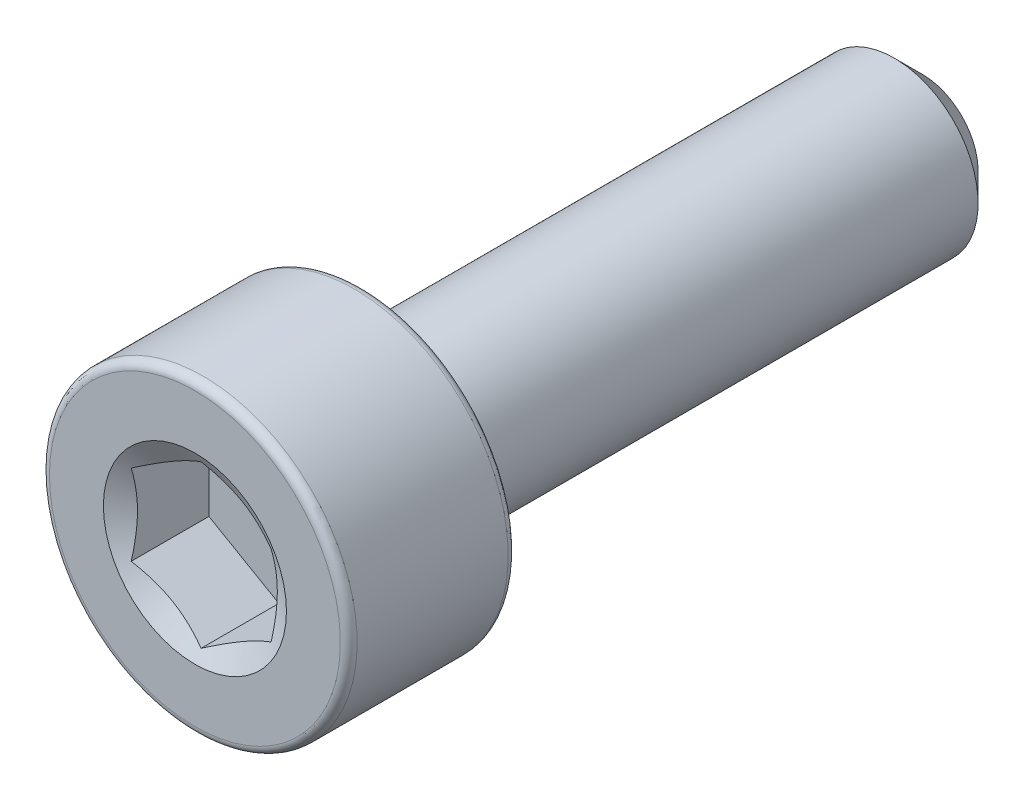
ISO-10303-21;
HEADER;
FILE_DESCRIPTION(('STEP AP214'),'2;1');
FILE_NAME('part.step','',(''),(''),'','','');
FILE_SCHEMA(('AUTOMOTIVE_DESIGN { 1 0 10303 214 1 1 1 1 }'));
ENDSEC;
DATA;
#1=APPLICATION_CONTEXT('core data for automotive mechanical design processes');
#2=APPLICATION_PROTOCOL_DEFINITION('international standard','automotive_design',2000,#1);
#3=PRODUCT_CONTEXT('',#1,'mechanical');
#4=PRODUCT('Part','Part','',(#3));
#5=PRODUCT_RELATED_PRODUCT_CATEGORY('part','',(#4));
#6=PRODUCT_DEFINITION_FORMATION('','',#4);
#7=PRODUCT_DEFINITION_CONTEXT('part definition',#1,'design');
#8=PRODUCT_DEFINITION('design','',#6,#7);
#9=PRODUCT_DEFINITION_SHAPE('','',#8);
#10=(LENGTH_UNIT() NAMED_UNIT(*) SI_UNIT(.MILLI.,.METRE.));
#11=(NAMED_UNIT(*) PLANE_ANGLE_UNIT() SI_UNIT($,.RADIAN.));
#12=(NAMED_UNIT(*) SI_UNIT($,.STERADIAN.) SOLID_ANGLE_UNIT());
#13=UNCERTAINTY_MEASURE_WITH_UNIT(LENGTH_MEASURE(1.E-05),#10,'distance_accuracy_value','');
#14=(GEOMETRIC_REPRESENTATION_CONTEXT(3) GLOBAL_UNCERTAINTY_ASSIGNED_CONTEXT((#13)) GLOBAL_UNIT_ASSIGNED_CONTEXT((#10,
#11,#12)) REPRESENTATION_CONTEXT('',''));
#15=CARTESIAN_POINT('',(0.,0.,0.));
#16=DIRECTION('',(0.,0.,1.));
#17=DIRECTION('',(1.,0.,0.));
#18=AXIS2_PLACEMENT_3D('',#15,#16,#17);
#19=CARTESIAN_POINT('',(0.,0.,-6.5));
#20=DIRECTION('',(0.,0.,-1.));
#21=DIRECTION('',(-1.,0.,0.));
#22=AXIS2_PLACEMENT_3D('',#19,#20,#21);
#23=PLANE('',#22);
#24=CARTESIAN_POINT('',(0.,0.,-6.5));
#25=DIRECTION('',(0.,0.,-1.));
#26=DIRECTION('',(-1.,0.,0.));
#27=AXIS2_PLACEMENT_3D('',#24,#25,#26);
#28=CIRCLE('',#27,1.);
#29=CARTESIAN_POINT('',(-1.,0.,-6.5));
#30=VERTEX_POINT('',#29);
#31=EDGE_CURVE('E61',#30,#30,#28,.T.);
#32=ORIENTED_EDGE('',*,*,#31,.T.);
#33=EDGE_LOOP('',(#32));
#34=FACE_BOUND('',#33,.T.);
#35=ADVANCED_FACE('F47',(#34),#23,.T.);
#36=CARTESIAN_POINT('',(0.,0.,-6.5));
#37=DIRECTION('',(0.,0.,1.));
#38=DIRECTION('',(1.,0.,0.));
#39=AXIS2_PLACEMENT_3D('',#36,#37,#38);
#40=CONICAL_SURFACE('',#39,1.,0.785398163397449);
#41=CARTESIAN_POINT('',(0.,0.,-6.));
#42=DIRECTION('',(0.,0.,-1.));
#43=DIRECTION('',(-1.,0.,0.));
#44=AXIS2_PLACEMENT_3D('',#41,#42,#43);
#45=CIRCLE('',#44,1.50000000000001);
#46=CARTESIAN_POINT('',(-1.50000000000001,0.,-6.));
#47=VERTEX_POINT('',#46);
#48=EDGE_CURVE('E155',#47,#47,#45,.T.);
#49=ORIENTED_EDGE('',*,*,#48,.T.);
#50=EDGE_LOOP('',(#49));
#51=FACE_BOUND('',#50,.T.);
#52=ORIENTED_EDGE('',*,*,#31,.F.);
#53=EDGE_LOOP('',(#52));
#54=FACE_BOUND('',#53,.T.);
#55=ADVANCED_FACE('F163',(#51,#54),#40,.T.);
#56=CARTESIAN_POINT('',(0.,0.,-6.5));
#57=DIRECTION('',(0.,0.,-1.));
#58=DIRECTION('',(-1.,0.,0.));
#59=AXIS2_PLACEMENT_3D('',#56,#57,#58);
#60=CYLINDRICAL_SURFACE('',#59,1.5);
#61=CARTESIAN_POINT('',(0.,0.,3.5));
#62=DIRECTION('',(0.,0.,-1.));
#63=DIRECTION('',(-1.,0.,0.));
#64=AXIS2_PLACEMENT_3D('',#61,#62,#63);
#65=CIRCLE('',#64,1.5);
#66=CARTESIAN_POINT('',(-1.5,0.,3.5));
#67=VERTEX_POINT('',#66);
#68=EDGE_CURVE('E151',#67,#67,#65,.T.);
#69=ORIENTED_EDGE('',*,*,#68,.T.);
#70=EDGE_LOOP('',(#69));
#71=FACE_BOUND('',#70,.T.);
#72=ORIENTED_EDGE('',*,*,#48,.F.);
#73=EDGE_LOOP('',(#72));
#74=FACE_BOUND('',#73,.T.);
#75=ADVANCED_FACE('F165',(#71,#74),#60,.T.);
#76=CARTESIAN_POINT('',(0.,1.5,3.5));
#77=DIRECTION('',(0.,0.,-1.));
#78=DIRECTION('',(-1.,0.,0.));
#79=AXIS2_PLACEMENT_3D('',#76,#77,#78);
#80=PLANE('',#79);
#81=CARTESIAN_POINT('',(0.,0.,3.5));
#82=DIRECTION('',(0.,0.,-1.));
#83=DIRECTION('',(-1.,0.,0.));
#84=AXIS2_PLACEMENT_3D('',#81,#82,#83);
#85=CIRCLE('',#84,2.6);
#86=CARTESIAN_POINT('',(-2.6,0.,3.5));
#87=VERTEX_POINT('',#86);
#88=EDGE_CURVE('E147',#87,#87,#85,.T.);
#89=ORIENTED_EDGE('',*,*,#88,.T.);
#90=EDGE_LOOP('',(#89));
#91=FACE_BOUND('',#90,.T.);
#92=ORIENTED_EDGE('',*,*,#68,.F.);
#93=EDGE_LOOP('',(#92));
#94=FACE_BOUND('',#93,.T.);
#95=ADVANCED_FACE('F171',(#91,#94),#80,.T.);
#96=CARTESIAN_POINT('',(0.,0.,3.65));
#97=DIRECTION('',(0.,0.,-1.));
#98=DIRECTION('',(-1.,0.,0.));
#99=AXIS2_PLACEMENT_3D('',#96,#97,#98);
#100=TOROIDAL_SURFACE('',#99,2.6,0.15);
#101=CARTESIAN_POINT('',(0.,0.,3.65));
#102=DIRECTION('',(0.,0.,-1.));
#103=DIRECTION('',(-1.,0.,0.));
#104=AXIS2_PLACEMENT_3D('',#101,#102,#103);
#105=CIRCLE('',#104,2.75);
#106=CARTESIAN_POINT('',(-2.75,0.,3.65));
#107=VERTEX_POINT('',#106);
#108=EDGE_CURVE('E143',#107,#107,#105,.T.);
#109=ORIENTED_EDGE('',*,*,#108,.T.);
#110=EDGE_LOOP('',(#109));
#111=FACE_BOUND('',#110,.T.);
#112=ORIENTED_EDGE('',*,*,#88,.F.);
#113=EDGE_LOOP('',(#112));
#114=FACE_BOUND('',#113,.T.);
#115=ADVANCED_FACE('F177',(#111,#114),#100,.T.);
#116=CARTESIAN_POINT('',(0.,0.,-6.5));
#117=DIRECTION('',(0.,0.,-1.));
#118=DIRECTION('',(-1.,0.,0.));
#119=AXIS2_PLACEMENT_3D('',#116,#117,#118);
#120=CYLINDRICAL_SURFACE('',#119,2.75);
#121=CARTESIAN_POINT('',(0.,0.,6.35));
#122=DIRECTION('',(0.,0.,-1.));
#123=DIRECTION('',(-1.,0.,0.));
#124=AXIS2_PLACEMENT_3D('',#121,#122,#123);
#125=CIRCLE('',#124,2.75);
#126=CARTESIAN_POINT('',(-2.75,0.,6.35));
#127=VERTEX_POINT('',#126);
#128=EDGE_CURVE('E139',#127,#127,#125,.T.);
#129=ORIENTED_EDGE('',*,*,#128,.T.);
#130=EDGE_LOOP('',(#129));
#131=FACE_BOUND('',#130,.T.);
#132=ORIENTED_EDGE('',*,*,#108,.F.);
#133=EDGE_LOOP('',(#132));
#134=FACE_BOUND('',#133,.T.);
#135=ADVANCED_FACE('F181',(#131,#134),#120,.T.);
#136=CARTESIAN_POINT('',(0.,0.,6.35));
#137=DIRECTION('',(0.,0.,-1.));
#138=DIRECTION('',(-1.,0.,0.));
#139=AXIS2_PLACEMENT_3D('',#136,#137,#138);
#140=TOROIDAL_SURFACE('',#139,2.6,0.150000000000001);
#141=CARTESIAN_POINT('',(0.,0.,6.5));
#142=DIRECTION('',(0.,0.,-1.));
#143=DIRECTION('',(-1.,0.,0.));
#144=AXIS2_PLACEMENT_3D('',#141,#142,#143);
#145=CIRCLE('',#144,2.6);
#146=CARTESIAN_POINT('',(-2.6,0.,6.5));
#147=VERTEX_POINT('',#146);
#148=EDGE_CURVE('E135',#147,#147,#145,.T.);
#149=ORIENTED_EDGE('',*,*,#148,.T.);
#150=EDGE_LOOP('',(#149));
#151=FACE_BOUND('',#150,.T.);
#152=ORIENTED_EDGE('',*,*,#128,.F.);
#153=EDGE_LOOP('',(#152));
#154=FACE_BOUND('',#153,.T.);
#155=ADVANCED_FACE('F185',(#151,#154),#140,.T.);
#156=CARTESIAN_POINT('',(0.,2.6,6.5));
#157=DIRECTION('',(0.,0.,1.));
#158=DIRECTION('',(1.,0.,0.));
#159=AXIS2_PLACEMENT_3D('',#156,#157,#158);
#160=PLANE('',#159);
#161=CARTESIAN_POINT('',(0.,0.,6.5));
#162=DIRECTION('',(0.,0.,1.));
#163=DIRECTION('',(1.,0.,0.));
#164=AXIS2_PLACEMENT_3D('',#161,#162,#163);
#165=CIRCLE('',#164,1.63614639414505);
#166=CARTESIAN_POINT('',(1.63614639414505,0.,6.5));
#167=VERTEX_POINT('',#166);
#168=EDGE_CURVE('E293',#167,#167,#165,.T.);
#169=ORIENTED_EDGE('',*,*,#168,.F.);
#170=EDGE_LOOP('',(#169));
#171=FACE_BOUND('',#170,.T.);
#172=ORIENTED_EDGE('',*,*,#148,.F.);
#173=EDGE_LOOP('',(#172));
#174=FACE_BOUND('',#173,.T.);
#175=ADVANCED_FACE('F189',(#171,#174),#160,.T.);
#176=CARTESIAN_POINT('',(0.,0.,6.5));
#177=DIRECTION('',(0.,0.,1.));
#178=DIRECTION('',(1.,0.,0.));
#179=AXIS2_PLACEMENT_3D('',#176,#177,#178);
#180=CONICAL_SURFACE('',#179,1.63614639414505,1.0471975511966);
#181=ORIENTED_EDGE('',*,*,#168,.T.);
#182=EDGE_LOOP('',(#181));
#183=FACE_BOUND('',#182,.T.);
#184=CARTESIAN_POINT('',(1.2502,0.721572366433195,6.38877044690608));
#185=CARTESIAN_POINT('',(1.19526669476823,0.75328812499623,6.37044968700374));
#186=CARTESIAN_POINT('',(1.13985921349976,0.785277649221703,6.35378707844069));
#187=CARTESIAN_POINT('',(1.02808463239966,0.849810733708404,6.32470107618582));
#188=CARTESIAN_POINT('',(0.971715545158287,0.882355441401182,6.3122879742161));
#189=CARTESIAN_POINT('',(0.859676025913013,0.947041487997317,6.29296345987607));
#190=CARTESIAN_POINT('',(0.804022841540768,0.979172868975893,6.28592346168749));
#191=CARTESIAN_POINT('',(0.692454346091606,1.04358696985655,6.27751620487069));
#192=CARTESIAN_POINT('',(0.636539441062398,1.07586945532687,6.27614198744478));
#193=CARTESIAN_POINT('',(0.532042078818273,1.13620103554812,6.27898710960797));
#194=CARTESIAN_POINT('',(0.483444050118683,1.16425912049992,6.28250787106007));
#195=CARTESIAN_POINT('',(0.386564637826761,1.22019247526559,6.29367088493931));
#196=CARTESIAN_POINT('',(0.338283589807836,1.24806755133608,6.30131695781273));
#197=CARTESIAN_POINT('',(0.241204116145956,1.30411641158755,6.32043322694059));
#198=CARTESIAN_POINT('',(0.1924179896481,1.33228309485381,6.33198452921971));
#199=CARTESIAN_POINT('',(0.0955737477078976,1.38819614400745,6.35820208693394));
#200=CARTESIAN_POINT('',(0.0475143896730355,1.41594322730595,6.37286217437916));
#201=CARTESIAN_POINT('',(-0.000199999999999989,1.4434911430279,6.38877044690608));
#202=B_SPLINE_CURVE_WITH_KNOTS('',3,(#184,#185,#186,#187,#188,#189,#190,#191,#192,#193,#194,
#195,#196,#197,#198,#199,#200,#201),.UNSPECIFIED.,.F.,.F.,(4,2,2,2,2,2,2,2,4),(0.,
0.198150821029559,0.396778196315219,0.590488617354398,0.78396104931718,0.952480056398644,
1.12115539730009,1.29357430343589,1.4656542697693),.UNSPECIFIED.);
#203=CARTESIAN_POINT('',(1.25,0.721687836487033,6.38870377224005));
#204=VERTEX_POINT('',#203);
#205=CARTESIAN_POINT('',(0.,1.44337567297406,6.38870377224005));
#206=VERTEX_POINT('',#205);
#207=EDGE_CURVE('E116',#204,#206,#202,.T.);
#208=ORIENTED_EDGE('',*,*,#207,.F.);
#209=CARTESIAN_POINT('',(1.25,-1.89493751838585,6.86600491612075));
#210=CARTESIAN_POINT('',(1.25,-1.8406706655359,6.83985913696477));
#211=CARTESIAN_POINT('',(1.25,-1.78627450159955,6.81397718008944));
#212=CARTESIAN_POINT('',(1.25,-1.6771542860939,6.76289014495151));
#213=CARTESIAN_POINT('',(1.25,-1.62243018006471,6.73768518315142));
#214=CARTESIAN_POINT('',(1.25,-1.51228150660141,6.68796514956817));
#215=CARTESIAN_POINT('',(1.25,-1.45685471363781,6.66345498656184));
#216=CARTESIAN_POINT('',(1.25,-1.34554530711243,6.61549912463354));
#217=CARTESIAN_POINT('',(1.25,-1.28966271671259,6.59205337201483));
#218=CARTESIAN_POINT('',(1.25,-1.17576624467955,6.5458644070109));
#219=CARTESIAN_POINT('',(1.25,-1.11773662338739,6.52315949733902));
#220=CARTESIAN_POINT('',(1.25,-1.00099484939335,6.4795841161061));
#221=CARTESIAN_POINT('',(1.25,-0.942282613107525,6.45871387193022));
#222=CARTESIAN_POINT('',(1.25,-0.765204349689548,6.39970721918192));
#223=CARTESIAN_POINT('',(1.25,-0.645583882597417,6.36504221898047));
#224=CARTESIAN_POINT('',(1.25,-0.463875702209305,6.32448382828725));
#225=CARTESIAN_POINT('',(1.25,-0.403068506127042,6.31288446104471));
#226=CARTESIAN_POINT('',(1.25,-0.280742753480581,6.29425184547974));
#227=CARTESIAN_POINT('',(1.25,-0.219224254757729,6.28721822850307));
#228=CARTESIAN_POINT('',(1.25,-0.0965698763728656,6.27836802265131));
#229=CARTESIAN_POINT('',(1.25,-0.0354387064128367,6.27648784576509));
#230=CARTESIAN_POINT('',(1.25,0.0867606380824929,6.27793281417568));
#231=CARTESIAN_POINT('',(1.25,0.147828809085717,6.28125823697792));
#232=CARTESIAN_POINT('',(1.25,0.296976974516787,6.29544420543106));
#233=CARTESIAN_POINT('',(1.25,0.384798095172699,6.30902990246888));
#234=CARTESIAN_POINT('',(1.25,0.558777035574827,6.34447190806478));
#235=CARTESIAN_POINT('',(1.25,0.644932779078741,6.36633791854767));
#236=CARTESIAN_POINT('',(1.25,0.77380914518999,6.40387295213096));
#237=CARTESIAN_POINT('',(1.25,0.81719238174285,6.41735279334266));
#238=CARTESIAN_POINT('',(1.25,0.903507427578147,6.44560647226415));
#239=CARTESIAN_POINT('',(1.25,0.946439496790639,6.4603795133102));
#240=CARTESIAN_POINT('',(1.25,1.0319081887352,6.49100070625673));
#241=CARTESIAN_POINT('',(1.25,1.07444487142949,6.50684869200918));
#242=CARTESIAN_POINT('',(1.25,1.1591793213938,6.53944353145432));
#243=CARTESIAN_POINT('',(1.25,1.20137703155215,6.55619053311117));
#244=CARTESIAN_POINT('',(1.25,1.31147066873609,6.6010154405937));
#245=CARTESIAN_POINT('',(1.25,1.37912101228275,6.62969595195012));
#246=CARTESIAN_POINT('',(1.25,1.51378271024307,6.68852402727517));
#247=CARTESIAN_POINT('',(1.25,1.58079400934832,6.71867171687233));
#248=CARTESIAN_POINT('',(1.25,1.78108956687594,6.81078601123408));
#249=CARTESIAN_POINT('',(1.25,1.91360872404133,6.87441259290478));
#250=CARTESIAN_POINT('',(1.25,2.1774904257434,7.00442585055039));
#251=CARTESIAN_POINT('',(1.25,2.30885117753144,7.07081611925632));
#252=CARTESIAN_POINT('',(1.25,2.57065126490253,7.2053391118623));
#253=CARTESIAN_POINT('',(1.25,2.70109073231446,7.2734715797448));
#254=CARTESIAN_POINT('',(1.25,2.94850263370539,7.40414820328686));
#255=CARTESIAN_POINT('',(1.25,3.06553428019949,7.46658065906644));
#256=CARTESIAN_POINT('',(1.25,3.29922001606908,7.59215959614652));
#257=CARTESIAN_POINT('',(1.25,3.41587408902236,7.6553061079814));
#258=CARTESIAN_POINT('',(1.25,3.64856969126785,7.78195631097187));
#259=CARTESIAN_POINT('',(1.25,3.76461202236081,7.84545853098273));
#260=CARTESIAN_POINT('',(1.25,3.99646186521794,7.97287436696805));
#261=CARTESIAN_POINT('',(1.25,4.1122693903072,8.03678795868639));
#262=CARTESIAN_POINT('',(1.25,4.22799321071854,8.10085183344895));
#263=B_SPLINE_CURVE_WITH_KNOTS('',3,(#209,#210,#211,#212,#213,#214,#215,#216,#217,#218,#219,
#220,#221,#222,#223,#224,#225,#226,#227,#228,#229,#230,#231,#232,#233,#234,#235,#236,#237,#238,
#239,#240,#241,#242,#243,#244,#245,#246,#247,#248,#249,#250,#251,#252,#253,#254,#255,#256,#257,
#258,#259,#260,#261,#262),.UNSPECIFIED.,.F.,.F.,(4,2,2,2,2,2,2,2,2,2,2,2,2,2,2,2,2,2,2,2,2,2,2,
2,2,2,4),(0.,0.180713106709462,0.36145710467235,0.543260352902967,0.725054419415467,
0.911961247319592,1.09889120755788,1.47173308257774,1.65730634844025,1.84286462862096,
2.02612278274384,2.20939070651185,2.47544204664139,2.74180608470687,2.87807807877766,
3.0142667067179,3.15043433252001,3.28662443853954,3.50703539668476,3.72746526104871,
4.16841202675703,4.60995110052814,5.05142565849164,5.44935247276722,5.84729636797905,
6.24413951198687,6.64095946708081),.UNSPECIFIED.);
#264=CARTESIAN_POINT('',(1.25,-0.721687836487029,6.38870377224005));
#265=VERTEX_POINT('',#264);
#266=EDGE_CURVE('E235',#265,#204,#263,.T.);
#267=ORIENTED_EDGE('',*,*,#266,.F.);
#268=CARTESIAN_POINT('',(-0.000200000000001979,-1.4434911430279,6.38877044690608));
#269=CARTESIAN_POINT('',(0.0547333052317629,-1.41177538446486,6.37044968700374));
#270=CARTESIAN_POINT('',(0.110140786500237,-1.37978586023939,6.35378707844069));
#271=CARTESIAN_POINT('',(0.221915367600337,-1.31525277575269,6.32470107618582));
#272=CARTESIAN_POINT('',(0.278284454841708,-1.28270806805991,6.3122879742161));
#273=CARTESIAN_POINT('',(0.390323974086981,-1.21802202146378,6.29296345987607));
#274=CARTESIAN_POINT('',(0.445977158459226,-1.1858906404852,6.28592346168749));
#275=CARTESIAN_POINT('',(0.557545653908388,-1.12147653960455,6.27751620487069));
#276=CARTESIAN_POINT('',(0.613460558937597,-1.08919405413422,6.27614198744478));
#277=CARTESIAN_POINT('',(0.717957921181721,-1.02886247391297,6.27898710960797));
#278=CARTESIAN_POINT('',(0.766555949881312,-1.00080438896118,6.28250787106007));
#279=CARTESIAN_POINT('',(0.863435362173234,-0.944871034195501,6.29367088493931));
#280=CARTESIAN_POINT('',(0.911716410192159,-0.916995958125017,6.30131695781273));
#281=CARTESIAN_POINT('',(1.00879588385404,-0.860947097873544,6.32043322694058));
#282=CARTESIAN_POINT('',(1.0575820103519,-0.832780414607287,6.33198452921971));
#283=CARTESIAN_POINT('',(1.1544262522921,-0.776867365453646,6.35820208693394));
#284=CARTESIAN_POINT('',(1.20248561032696,-0.749120282155138,6.37286217437916));
#285=CARTESIAN_POINT('',(1.2502,-0.721572366433192,6.38877044690608));
#286=B_SPLINE_CURVE_WITH_KNOTS('',3,(#268,#269,#270,#271,#272,#273,#274,#275,#276,#277,#278,
#279,#280,#281,#282,#283,#284,#285),.UNSPECIFIED.,.F.,.F.,(4,2,2,2,2,2,2,2,4),(0.,
0.198150821029559,0.39677819631522,0.590488617354398,0.78396104931718,0.952480056398644,
1.1211553973001,1.2935743034359,1.4656542697693),.UNSPECIFIED.);
#287=CARTESIAN_POINT('',(0.,-1.44337567297406,6.38870377224005));
#288=VERTEX_POINT('',#287);
#289=EDGE_CURVE('E229',#288,#265,#286,.T.);
#290=ORIENTED_EDGE('',*,*,#289,.F.);
#291=CARTESIAN_POINT('',(-1.2502,-0.721572366433194,6.38877044690608));
#292=CARTESIAN_POINT('',(-1.19526669476823,-0.753288124996229,6.37044968700374));
#293=CARTESIAN_POINT('',(-1.13985921349976,-0.785277649221702,6.35378707844069));
#294=CARTESIAN_POINT('',(-1.02808463239966,-0.849810733708402,6.32470107618582));
#295=CARTESIAN_POINT('',(-0.971715545158288,-0.882355441401181,6.3122879742161));
#296=CARTESIAN_POINT('',(-0.859676025913014,-0.947041487997316,6.29296345987607));
#297=CARTESIAN_POINT('',(-0.804022841540769,-0.979172868975892,6.28592346168749));
#298=CARTESIAN_POINT('',(-0.692454346091608,-1.04358696985655,6.27751620487069));
#299=CARTESIAN_POINT('',(-0.636539441062399,-1.07586945532687,6.27614198744478));
#300=CARTESIAN_POINT('',(-0.532042078818275,-1.13620103554812,6.27898710960797));
#301=CARTESIAN_POINT('',(-0.483444050118684,-1.16425912049992,6.28250787106007));
#302=CARTESIAN_POINT('',(-0.386564637826762,-1.22019247526559,6.29367088493931));
#303=CARTESIAN_POINT('',(-0.338283589807837,-1.24806755133607,6.30131695781273));
#304=CARTESIAN_POINT('',(-0.241204116145958,-1.30411641158755,6.32043322694058));
#305=CARTESIAN_POINT('',(-0.192417989648102,-1.3322830948538,6.33198452921971));
#306=CARTESIAN_POINT('',(-0.0955737477078996,-1.38819614400745,6.35820208693395));
#307=CARTESIAN_POINT('',(-0.0475143896730377,-1.41594322730595,6.37286217437916));
#308=CARTESIAN_POINT('',(0.000199999999998015,-1.4434911430279,6.38877044690608));
#309=B_SPLINE_CURVE_WITH_KNOTS('',3,(#291,#292,#293,#294,#295,#296,#297,#298,#299,#300,#301,
#302,#303,#304,#305,#306,#307,#308),.UNSPECIFIED.,.F.,.F.,(4,2,2,2,2,2,2,2,4),(0.,
0.198150821029559,0.39677819631522,0.590488617354398,0.78396104931718,0.952480056398643,
1.12115539730009,1.29357430343589,1.4656542697693),.UNSPECIFIED.);
#310=CARTESIAN_POINT('',(-1.25,-0.721687836487031,6.38870377224005));
#311=VERTEX_POINT('',#310);
#312=EDGE_CURVE('E68',#311,#288,#309,.T.);
#313=ORIENTED_EDGE('',*,*,#312,.F.);
#314=CARTESIAN_POINT('',(-1.25,-1.89493751838585,6.86600491612075));
#315=CARTESIAN_POINT('',(-1.25,-1.84067066553591,6.83985913696478));
#316=CARTESIAN_POINT('',(-1.25,-1.78627450159955,6.81397718008944));
#317=CARTESIAN_POINT('',(-1.25,-1.6771542860939,6.76289014495151));
#318=CARTESIAN_POINT('',(-1.25,-1.62243018006471,6.73768518315142));
#319=CARTESIAN_POINT('',(-1.25,-1.51228150660141,6.68796514956817));
#320=CARTESIAN_POINT('',(-1.25,-1.45685471363782,6.66345498656184));
#321=CARTESIAN_POINT('',(-1.25,-1.34554530711243,6.61549912463354));
#322=CARTESIAN_POINT('',(-1.25,-1.28966271671259,6.59205337201483));
#323=CARTESIAN_POINT('',(-1.25,-1.17576624467955,6.5458644070109));
#324=CARTESIAN_POINT('',(-1.25,-1.1177366233874,6.52315949733902));
#325=CARTESIAN_POINT('',(-1.25,-1.00099484939336,6.4795841161061));
#326=CARTESIAN_POINT('',(-1.25,-0.942282613107528,6.45871387193022));
#327=CARTESIAN_POINT('',(-1.25,-0.765204349689551,6.39970721918193));
#328=CARTESIAN_POINT('',(-1.25,-0.645583882597419,6.36504221898047));
#329=CARTESIAN_POINT('',(-1.25,-0.463875702209307,6.32448382828725));
#330=CARTESIAN_POINT('',(-1.25,-0.403068506127044,6.31288446104471));
#331=CARTESIAN_POINT('',(-1.25,-0.280742753480583,6.29425184547974));
#332=CARTESIAN_POINT('',(-1.25,-0.219224254757731,6.28721822850307));
#333=CARTESIAN_POINT('',(-1.25,-0.0965698763728669,6.27836802265131));
#334=CARTESIAN_POINT('',(-1.25,-0.0354387064128378,6.27648784576509));
#335=CARTESIAN_POINT('',(-1.25,0.0867606380824919,6.27793281417568));
#336=CARTESIAN_POINT('',(-1.25,0.147828809085716,6.28125823697792));
#337=CARTESIAN_POINT('',(-1.25,0.296976974516786,6.29544420543106));
#338=CARTESIAN_POINT('',(-1.25,0.384798095172698,6.30902990246888));
#339=CARTESIAN_POINT('',(-1.25,0.558777035574826,6.34447190806478));
#340=CARTESIAN_POINT('',(-1.25,0.64493277907874,6.36633791854767));
#341=CARTESIAN_POINT('',(-1.25,0.773809145189989,6.40387295213096));
#342=CARTESIAN_POINT('',(-1.25,0.81719238174285,6.41735279334266));
#343=CARTESIAN_POINT('',(-1.25,0.903507427578147,6.44560647226415));
#344=CARTESIAN_POINT('',(-1.25,0.946439496790639,6.4603795133102));
#345=CARTESIAN_POINT('',(-1.25,1.0319081887352,6.49100070625673));
#346=CARTESIAN_POINT('',(-1.25,1.07444487142949,6.50684869200918));
#347=CARTESIAN_POINT('',(-1.25,1.1591793213938,6.53944353145431));
#348=CARTESIAN_POINT('',(-1.25,1.20137703155215,6.55619053311117));
#349=CARTESIAN_POINT('',(-1.25,1.31147066873608,6.6010154405937));
#350=CARTESIAN_POINT('',(-1.25,1.37912101228275,6.62969595195013));
#351=CARTESIAN_POINT('',(-1.25,1.51378271024307,6.68852402727517));
#352=CARTESIAN_POINT('',(-1.25,1.58079400934832,6.71867171687233));
#353=CARTESIAN_POINT('',(-1.25,1.78108956687594,6.81078601123408));
#354=CARTESIAN_POINT('',(-1.25,1.91360872404133,6.87441259290478));
#355=CARTESIAN_POINT('',(-1.25,2.1774904257434,7.00442585055039));
#356=CARTESIAN_POINT('',(-1.25,2.30885117753144,7.07081611925632));
#357=CARTESIAN_POINT('',(-1.25,2.57065126490253,7.2053391118623));
#358=CARTESIAN_POINT('',(-1.25,2.70109073231446,7.2734715797448));
#359=CARTESIAN_POINT('',(-1.25,2.94850263370539,7.40414820328686));
#360=CARTESIAN_POINT('',(-1.25,3.06553428019949,7.46658065906644));
#361=CARTESIAN_POINT('',(-1.25,3.29922001606908,7.59215959614652));
#362=CARTESIAN_POINT('',(-1.25,3.41587408902236,7.6553061079814));
#363=CARTESIAN_POINT('',(-1.25,3.64856969126785,7.78195631097186));
#364=CARTESIAN_POINT('',(-1.25,3.76461202236081,7.84545853098273));
#365=CARTESIAN_POINT('',(-1.25,3.99646186521794,7.97287436696805));
#366=CARTESIAN_POINT('',(-1.25,4.1122693903072,8.03678795868639));
#367=CARTESIAN_POINT('',(-1.25,4.22799321071854,8.10085183344895));
#368=B_SPLINE_CURVE_WITH_KNOTS('',3,(#314,#315,#316,#317,#318,#319,#320,#321,#322,#323,#324,
#325,#326,#327,#328,#329,#330,#331,#332,#333,#334,#335,#336,#337,#338,#339,#340,#341,#342,#343,
#344,#345,#346,#347,#348,#349,#350,#351,#352,#353,#354,#355,#356,#357,#358,#359,#360,#361,#362,
#363,#364,#365,#366,#367),.UNSPECIFIED.,.F.,.F.,(4,2,2,2,2,2,2,2,2,2,2,2,2,2,2,2,2,2,2,2,2,2,2,
2,2,2,4),(0.,0.180713106709462,0.36145710467235,0.543260352902968,0.725054419415468,
0.911961247319592,1.09889120755788,1.47173308257774,1.65730634844025,1.84286462862096,
2.02612278274385,2.20939070651185,2.4754420466414,2.74180608470687,2.87807807877767,
3.0142667067179,3.15043433252002,3.28662443853954,3.50703539668476,3.72746526104871,
4.16841202675703,4.60995110052814,5.05142565849164,5.44935247276722,5.84729636797905,
6.24413951198687,6.64095946708082),.UNSPECIFIED.);
#369=CARTESIAN_POINT('',(-1.25,0.721687836487031,6.38870377224005));
#370=VERTEX_POINT('',#369);
#371=EDGE_CURVE('E11',#370,#311,#368,.F.);
#372=ORIENTED_EDGE('',*,*,#371,.F.);
#373=CARTESIAN_POINT('',(0.000200000000000072,1.4434911430279,6.38877044690608));
#374=CARTESIAN_POINT('',(-0.054733305231765,1.41177538446487,6.37044968700374));
#375=CARTESIAN_POINT('',(-0.110140786500239,1.37978586023939,6.35378707844069));
#376=CARTESIAN_POINT('',(-0.221915367600339,1.31525277575269,6.32470107618582));
#377=CARTESIAN_POINT('',(-0.27828445484171,1.28270806805991,6.3122879742161));
#378=CARTESIAN_POINT('',(-0.390323974086984,1.21802202146378,6.29296345987607));
#379=CARTESIAN_POINT('',(-0.445977158459229,1.1858906404852,6.28592346168749));
#380=CARTESIAN_POINT('',(-0.55754565390839,1.12147653960455,6.27751620487069));
#381=CARTESIAN_POINT('',(-0.613460558937599,1.08919405413422,6.27614198744478));
#382=CARTESIAN_POINT('',(-0.717957921181724,1.02886247391297,6.27898710960797));
#383=CARTESIAN_POINT('',(-0.766555949881314,1.00080438896118,6.28250787106007));
#384=CARTESIAN_POINT('',(-0.863435362173237,0.944871034195502,6.29367088493931));
#385=CARTESIAN_POINT('',(-0.911716410192162,0.916995958125018,6.30131695781273));
#386=CARTESIAN_POINT('',(-1.00879588385404,0.860947097873545,6.32043322694059));
#387=CARTESIAN_POINT('',(-1.0575820103519,0.832780414607288,6.33198452921971));
#388=CARTESIAN_POINT('',(-1.1544262522921,0.776867365453647,6.35820208693395));
#389=CARTESIAN_POINT('',(-1.20248561032696,0.749120282155139,6.37286217437916));
#390=CARTESIAN_POINT('',(-1.2502,0.721572366433193,6.38877044690608));
#391=B_SPLINE_CURVE_WITH_KNOTS('',3,(#373,#374,#375,#376,#377,#378,#379,#380,#381,#382,#383,
#384,#385,#386,#387,#388,#389,#390),.UNSPECIFIED.,.F.,.F.,(4,2,2,2,2,2,2,2,4),(0.,
0.198150821029559,0.39677819631522,0.590488617354399,0.78396104931718,0.952480056398645,
1.1211553973001,1.2935743034359,1.4656542697693),.UNSPECIFIED.);
#392=EDGE_CURVE('E106',#206,#370,#391,.T.);
#393=ORIENTED_EDGE('',*,*,#392,.F.);
#394=EDGE_LOOP('',(#208,#267,#290,#313,#372,#393));
#395=FACE_BOUND('',#394,.T.);
#396=ADVANCED_FACE('F105',(#183,#395),#180,.F.);
#397=CARTESIAN_POINT('',(0.,0.,5.));
#398=DIRECTION('',(0.,0.,1.));
#399=DIRECTION('',(1.,0.,0.));
#400=AXIS2_PLACEMENT_3D('',#397,#398,#399);
#401=PLANE('',#400);
#402=DIRECTION('',(-0.866025403784438,-0.5,0.));
#403=VECTOR('',#402,1.);
#404=CARTESIAN_POINT('',(0.,1.44337567297406,5.));
#405=LINE('',#404,#403);
#406=CARTESIAN_POINT('',(0.,1.44337567297406,5.));
#407=VERTEX_POINT('',#406);
#408=CARTESIAN_POINT('',(-1.25,0.721687836487031,5.));
#409=VERTEX_POINT('',#408);
#410=EDGE_CURVE('E115',#407,#409,#405,.T.);
#411=ORIENTED_EDGE('',*,*,#410,.T.);
#412=DIRECTION('',(0.,-1.,0.));
#413=VECTOR('',#412,1.);
#414=CARTESIAN_POINT('',(-1.25,0.721687836487031,5.));
#415=LINE('',#414,#413);
#416=CARTESIAN_POINT('',(-1.25,-0.721687836487031,5.));
#417=VERTEX_POINT('',#416);
#418=EDGE_CURVE('E120',#409,#417,#415,.T.);
#419=ORIENTED_EDGE('',*,*,#418,.T.);
#420=DIRECTION('',(0.866025403784439,-0.5,0.));
#421=VECTOR('',#420,1.);
#422=CARTESIAN_POINT('',(-1.25,-0.721687836487031,5.));
#423=LINE('',#422,#421);
#424=CARTESIAN_POINT('',(0.,-1.44337567297406,5.));
#425=VERTEX_POINT('',#424);
#426=EDGE_CURVE('E262',#417,#425,#423,.T.);
#427=ORIENTED_EDGE('',*,*,#426,.T.);
#428=DIRECTION('',(0.866025403784438,0.5,0.));
#429=VECTOR('',#428,1.);
#430=CARTESIAN_POINT('',(0.,-1.44337567297406,5.));
#431=LINE('',#430,#429);
#432=CARTESIAN_POINT('',(1.25,-0.721687836487029,5.));
#433=VERTEX_POINT('',#432);
#434=EDGE_CURVE('E267',#425,#433,#431,.T.);
#435=ORIENTED_EDGE('',*,*,#434,.T.);
#436=DIRECTION('',(0.,1.,0.));
#437=VECTOR('',#436,1.);
#438=CARTESIAN_POINT('',(1.25,-0.721687836487029,5.));
#439=LINE('',#438,#437);
#440=CARTESIAN_POINT('',(1.25,0.721687836487033,5.));
#441=VERTEX_POINT('',#440);
#442=EDGE_CURVE('E131',#433,#441,#439,.T.);
#443=ORIENTED_EDGE('',*,*,#442,.T.);
#444=DIRECTION('',(-0.866025403784439,0.5,0.));
#445=VECTOR('',#444,1.);
#446=CARTESIAN_POINT('',(1.25,0.721687836487033,5.));
#447=LINE('',#446,#445);
#448=EDGE_CURVE('E124',#441,#407,#447,.T.);
#449=ORIENTED_EDGE('',*,*,#448,.T.);
#450=EDGE_LOOP('',(#411,#419,#427,#435,#443,#449));
#451=FACE_BOUND('',#450,.T.);
#452=ADVANCED_FACE('F215',(#451),#401,.T.);
#453=CARTESIAN_POINT('',(-1.25,0.721687836487031,5.));
#454=DIRECTION('',(-1.,0.,0.));
#455=DIRECTION('',(0.,-1.,0.));
#456=AXIS2_PLACEMENT_3D('',#453,#454,#455);
#457=PLANE('',#456);
#458=DIRECTION('',(0.,0.,1.));
#459=VECTOR('',#458,1.);
#460=CARTESIAN_POINT('',(-1.25,0.721687836487031,5.));
#461=LINE('',#460,#459);
#462=EDGE_CURVE('E112',#409,#370,#461,.T.);
#463=ORIENTED_EDGE('',*,*,#462,.T.);
#464=ORIENTED_EDGE('',*,*,#371,.T.);
#465=DIRECTION('',(0.,0.,1.));
#466=VECTOR('',#465,1.);
#467=CARTESIAN_POINT('',(-1.25,-0.721687836487031,5.));
#468=LINE('',#467,#466);
#469=EDGE_CURVE('E123',#417,#311,#468,.T.);
#470=ORIENTED_EDGE('',*,*,#469,.F.);
#471=ORIENTED_EDGE('',*,*,#418,.F.);
#472=EDGE_LOOP('',(#463,#464,#470,#471));
#473=FACE_BOUND('',#472,.T.);
#474=ADVANCED_FACE('F118',(#473),#457,.F.);
#475=CARTESIAN_POINT('',(-1.25,-0.721687836487031,5.));
#476=DIRECTION('',(-0.5,-0.866025403784438,0.));
#477=DIRECTION('',(0.866025403784439,-0.5,0.));
#478=AXIS2_PLACEMENT_3D('',#475,#476,#477);
#479=PLANE('',#478);
#480=ORIENTED_EDGE('',*,*,#469,.T.);
#481=ORIENTED_EDGE('',*,*,#312,.T.);
#482=DIRECTION('',(0.,0.,1.));
#483=VECTOR('',#482,1.);
#484=CARTESIAN_POINT('',(0.,-1.44337567297406,5.));
#485=LINE('',#484,#483);
#486=EDGE_CURVE('E128',#425,#288,#485,.T.);
#487=ORIENTED_EDGE('',*,*,#486,.F.);
#488=ORIENTED_EDGE('',*,*,#426,.F.);
#489=EDGE_LOOP('',(#480,#481,#487,#488));
#490=FACE_BOUND('',#489,.T.);
#491=ADVANCED_FACE('F251',(#490),#479,.F.);
#492=CARTESIAN_POINT('',(0.,-1.44337567297406,5.));
#493=DIRECTION('',(0.5,-0.866025403784439,0.));
#494=DIRECTION('',(0.866025403784439,0.5,0.));
#495=AXIS2_PLACEMENT_3D('',#492,#493,#494);
#496=PLANE('',#495);
#497=ORIENTED_EDGE('',*,*,#486,.T.);
#498=ORIENTED_EDGE('',*,*,#289,.T.);
#499=DIRECTION('',(0.,0.,1.));
#500=VECTOR('',#499,1.);
#501=CARTESIAN_POINT('',(1.25,-0.721687836487029,5.));
#502=LINE('',#501,#500);
#503=EDGE_CURVE('E283',#433,#265,#502,.T.);
#504=ORIENTED_EDGE('',*,*,#503,.F.);
#505=ORIENTED_EDGE('',*,*,#434,.F.);
#506=EDGE_LOOP('',(#497,#498,#504,#505));
#507=FACE_BOUND('',#506,.T.);
#508=ADVANCED_FACE('F246',(#507),#496,.F.);
#509=CARTESIAN_POINT('',(1.25,-0.721687836487029,5.));
#510=DIRECTION('',(1.,0.,0.));
#511=DIRECTION('',(0.,0.,-1.));
#512=AXIS2_PLACEMENT_3D('',#509,#510,#511);
#513=PLANE('',#512);
#514=ORIENTED_EDGE('',*,*,#503,.T.);
#515=ORIENTED_EDGE('',*,*,#266,.T.);
#516=DIRECTION('',(0.,0.,1.));
#517=VECTOR('',#516,1.);
#518=CARTESIAN_POINT('',(1.25,0.721687836487033,5.));
#519=LINE('',#518,#517);
#520=EDGE_CURVE('E279',#441,#204,#519,.T.);
#521=ORIENTED_EDGE('',*,*,#520,.F.);
#522=ORIENTED_EDGE('',*,*,#442,.F.);
#523=EDGE_LOOP('',(#514,#515,#521,#522));
#524=FACE_BOUND('',#523,.T.);
#525=ADVANCED_FACE('F243',(#524),#513,.F.);
#526=CARTESIAN_POINT('',(1.25,0.721687836487033,5.));
#527=DIRECTION('',(0.5,0.866025403784439,0.));
#528=DIRECTION('',(-0.866025403784439,0.5,0.));
#529=AXIS2_PLACEMENT_3D('',#526,#527,#528);
#530=PLANE('',#529);
#531=ORIENTED_EDGE('',*,*,#520,.T.);
#532=ORIENTED_EDGE('',*,*,#207,.T.);
#533=DIRECTION('',(0.,0.,1.));
#534=VECTOR('',#533,1.);
#535=CARTESIAN_POINT('',(0.,1.44337567297406,5.));
#536=LINE('',#535,#534);
#537=EDGE_CURVE('E75',#407,#206,#536,.T.);
#538=ORIENTED_EDGE('',*,*,#537,.F.);
#539=ORIENTED_EDGE('',*,*,#448,.F.);
#540=EDGE_LOOP('',(#531,#532,#538,#539));
#541=FACE_BOUND('',#540,.T.);
#542=ADVANCED_FACE('F196',(#541),#530,.F.);
#543=CARTESIAN_POINT('',(0.,1.44337567297406,5.));
#544=DIRECTION('',(-0.5,0.866025403784438,0.));
#545=DIRECTION('',(-0.866025403784438,-0.5,0.));
#546=AXIS2_PLACEMENT_3D('',#543,#544,#545);
#547=PLANE('',#546);
#548=ORIENTED_EDGE('',*,*,#537,.T.);
#549=ORIENTED_EDGE('',*,*,#392,.T.);
#550=ORIENTED_EDGE('',*,*,#462,.F.);
#551=ORIENTED_EDGE('',*,*,#410,.F.);
#552=EDGE_LOOP('',(#548,#549,#550,#551));
#553=FACE_BOUND('',#552,.T.);
#554=ADVANCED_FACE('F111',(#553),#547,.F.);
#555=CLOSED_SHELL('',(#35,#55,#75,#95,#115,#135,#155,#175,#396,#452,#474,#491,#508,#525,#542,#554));
#556=MANIFOLD_SOLID_BREP('B2',#555);
#557=ADVANCED_BREP_SHAPE_REPRESENTATION('',(#18,#556),#14);
#558=SHAPE_DEFINITION_REPRESENTATION(#9,#557);
ENDSEC;
END-ISO-10303-21;
